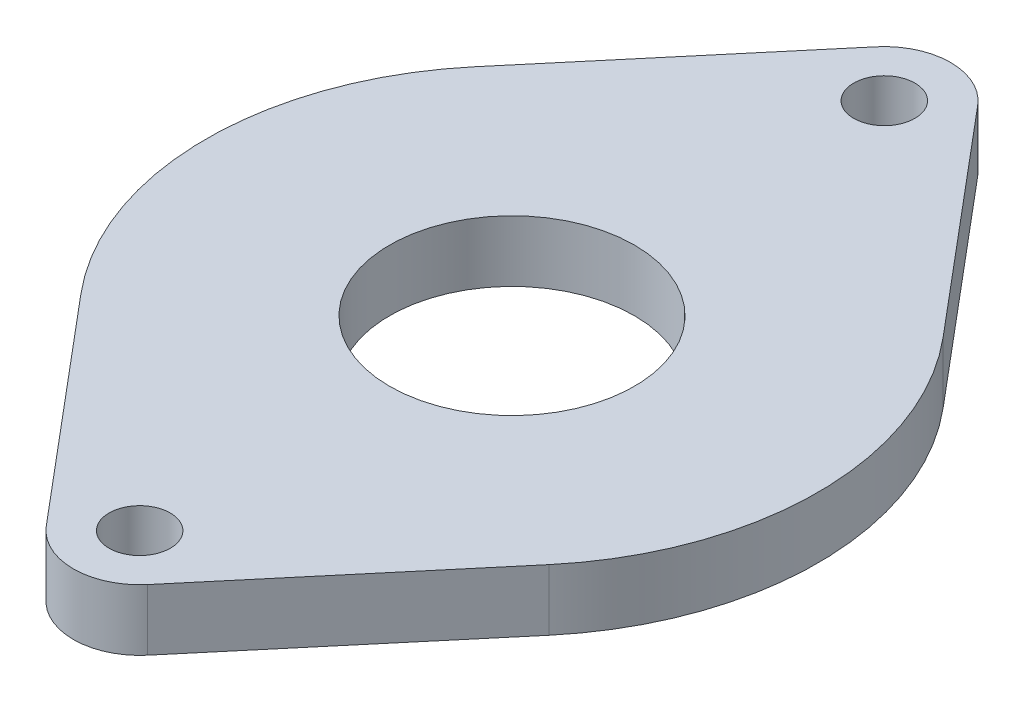
ISO-10303-21;
HEADER;
FILE_DESCRIPTION(('STEP AP214'),'2;1');
FILE_NAME('part.step','',(''),(''),'','','');
FILE_SCHEMA(('AUTOMOTIVE_DESIGN { 1 0 10303 214 1 1 1 1 }'));
ENDSEC;
DATA;
#1=APPLICATION_CONTEXT('core data for automotive mechanical design processes');
#2=APPLICATION_PROTOCOL_DEFINITION('international standard','automotive_design',2000,#1);
#3=PRODUCT_CONTEXT('',#1,'mechanical');
#4=PRODUCT('Part','Part','',(#3));
#5=PRODUCT_RELATED_PRODUCT_CATEGORY('part','',(#4));
#6=PRODUCT_DEFINITION_FORMATION('','',#4);
#7=PRODUCT_DEFINITION_CONTEXT('part definition',#1,'design');
#8=PRODUCT_DEFINITION('design','',#6,#7);
#9=PRODUCT_DEFINITION_SHAPE('','',#8);
#10=(LENGTH_UNIT() NAMED_UNIT(*) SI_UNIT(.MILLI.,.METRE.));
#11=(NAMED_UNIT(*) PLANE_ANGLE_UNIT() SI_UNIT($,.RADIAN.));
#12=(NAMED_UNIT(*) SI_UNIT($,.STERADIAN.) SOLID_ANGLE_UNIT());
#13=UNCERTAINTY_MEASURE_WITH_UNIT(LENGTH_MEASURE(1.E-05),#10,'distance_accuracy_value','');
#14=(GEOMETRIC_REPRESENTATION_CONTEXT(3) GLOBAL_UNCERTAINTY_ASSIGNED_CONTEXT((#13)) GLOBAL_UNIT_ASSIGNED_CONTEXT((#10,
#11,#12)) REPRESENTATION_CONTEXT('',''));
#15=CARTESIAN_POINT('',(0.,0.,0.));
#16=DIRECTION('',(0.,0.,1.));
#17=DIRECTION('',(1.,0.,0.));
#18=AXIS2_PLACEMENT_3D('',#15,#16,#17);
#19=CARTESIAN_POINT('',(0.,3.,18.25));
#20=DIRECTION('',(0.,-1.,0.));
#21=DIRECTION('',(0.,0.,-1.));
#22=AXIS2_PLACEMENT_3D('',#19,#20,#21);
#23=CYLINDRICAL_SURFACE('',#22,3.25);
#24=CARTESIAN_POINT('',(0.,0.,18.25));
#25=DIRECTION('',(0.,1.,0.));
#26=DIRECTION('',(0.,0.,1.));
#27=AXIS2_PLACEMENT_3D('',#24,#25,#26);
#28=CIRCLE('',#27,3.25);
#29=CARTESIAN_POINT('',(2.48678247354789,0.,20.3424657534247));
#30=VERTEX_POINT('',#29);
#31=CARTESIAN_POINT('',(-2.48678247354789,0.,20.3424657534247));
#32=VERTEX_POINT('',#31);
#33=EDGE_CURVE('E140',#30,#32,#28,.F.);
#34=ORIENTED_EDGE('',*,*,#33,.F.);
#35=DIRECTION('',(0.,-1.,0.));
#36=VECTOR('',#35,1.);
#37=CARTESIAN_POINT('',(2.48678247354789,3.,20.3424657534247));
#38=LINE('',#37,#36);
#39=CARTESIAN_POINT('',(2.48678247354789,3.,20.3424657534247));
#40=VERTEX_POINT('',#39);
#41=EDGE_CURVE('E11',#40,#30,#38,.T.);
#42=ORIENTED_EDGE('',*,*,#41,.F.);
#43=CARTESIAN_POINT('',(0.,3.,18.25));
#44=DIRECTION('',(0.,1.,0.));
#45=DIRECTION('',(0.,0.,1.));
#46=AXIS2_PLACEMENT_3D('',#43,#44,#45);
#47=CIRCLE('',#46,3.25);
#48=CARTESIAN_POINT('',(-2.48678247354789,3.,20.3424657534247));
#49=VERTEX_POINT('',#48);
#50=EDGE_CURVE('E167',#40,#49,#47,.F.);
#51=ORIENTED_EDGE('',*,*,#50,.T.);
#52=DIRECTION('',(0.,-1.,0.));
#53=VECTOR('',#52,1.);
#54=CARTESIAN_POINT('',(-2.48678247354789,3.,20.3424657534247));
#55=LINE('',#54,#53);
#56=EDGE_CURVE('E51',#49,#32,#55,.T.);
#57=ORIENTED_EDGE('',*,*,#56,.T.);
#58=EDGE_LOOP('',(#34,#42,#51,#57));
#59=FACE_BOUND('',#58,.T.);
#60=ADVANCED_FACE('F35',(#59),#23,.T.);
#61=CARTESIAN_POINT('',(11.477457570221,3.,9.65753424657534));
#62=DIRECTION('',(-0.765163838014736,0.,-0.643835616438356));
#63=DIRECTION('',(-0.643835616438356,0.,0.765163838014736));
#64=AXIS2_PLACEMENT_3D('',#61,#62,#63);
#65=PLANE('',#64);
#66=DIRECTION('',(0.643835616438356,0.,-0.765163838014736));
#67=VECTOR('',#66,1.);
#68=CARTESIAN_POINT('',(11.477457570221,0.,9.65753424657534));
#69=LINE('',#68,#67);
#70=CARTESIAN_POINT('',(11.477457570221,0.,9.65753424657534));
#71=VERTEX_POINT('',#70);
#72=EDGE_CURVE('E142',#30,#71,#69,.T.);
#73=ORIENTED_EDGE('',*,*,#72,.T.);
#74=DIRECTION('',(0.,-1.,0.));
#75=VECTOR('',#74,1.);
#76=CARTESIAN_POINT('',(11.477457570221,3.,9.65753424657534));
#77=LINE('',#76,#75);
#78=CARTESIAN_POINT('',(11.477457570221,3.,9.65753424657534));
#79=VERTEX_POINT('',#78);
#80=EDGE_CURVE('E43',#79,#71,#77,.T.);
#81=ORIENTED_EDGE('',*,*,#80,.F.);
#82=DIRECTION('',(0.643835616438356,0.,-0.765163838014736));
#83=VECTOR('',#82,1.);
#84=CARTESIAN_POINT('',(11.477457570221,3.,9.65753424657534));
#85=LINE('',#84,#83);
#86=EDGE_CURVE('E194',#40,#79,#85,.T.);
#87=ORIENTED_EDGE('',*,*,#86,.F.);
#88=ORIENTED_EDGE('',*,*,#41,.T.);
#89=EDGE_LOOP('',(#73,#81,#87,#88));
#90=FACE_BOUND('',#89,.T.);
#91=ADVANCED_FACE('F214',(#90),#65,.F.);
#92=CARTESIAN_POINT('',(0.,3.,0.));
#93=DIRECTION('',(0.,-1.,0.));
#94=DIRECTION('',(0.,0.,-1.));
#95=AXIS2_PLACEMENT_3D('',#92,#93,#94);
#96=CYLINDRICAL_SURFACE('',#95,15.);
#97=CARTESIAN_POINT('',(0.,0.,0.));
#98=DIRECTION('',(0.,1.,0.));
#99=DIRECTION('',(0.,0.,1.));
#100=AXIS2_PLACEMENT_3D('',#97,#98,#99);
#101=CIRCLE('',#100,15.);
#102=CARTESIAN_POINT('',(11.477457570221,0.,-9.65753424657534));
#103=VERTEX_POINT('',#102);
#104=EDGE_CURVE('E144',#71,#103,#101,.T.);
#105=ORIENTED_EDGE('',*,*,#104,.T.);
#106=DIRECTION('',(0.,-1.,0.));
#107=VECTOR('',#106,1.);
#108=CARTESIAN_POINT('',(11.477457570221,3.,-9.65753424657534));
#109=LINE('',#108,#107);
#110=CARTESIAN_POINT('',(11.477457570221,3.,-9.65753424657534));
#111=VERTEX_POINT('',#110);
#112=EDGE_CURVE('E173',#111,#103,#109,.T.);
#113=ORIENTED_EDGE('',*,*,#112,.F.);
#114=CARTESIAN_POINT('',(0.,3.,0.));
#115=DIRECTION('',(0.,1.,0.));
#116=DIRECTION('',(0.,0.,1.));
#117=AXIS2_PLACEMENT_3D('',#114,#115,#116);
#118=CIRCLE('',#117,15.);
#119=EDGE_CURVE('E181',#79,#111,#118,.T.);
#120=ORIENTED_EDGE('',*,*,#119,.F.);
#121=ORIENTED_EDGE('',*,*,#80,.T.);
#122=EDGE_LOOP('',(#105,#113,#120,#121));
#123=FACE_BOUND('',#122,.T.);
#124=ADVANCED_FACE('F179',(#123),#96,.T.);
#125=CARTESIAN_POINT('',(11.477457570221,3.,-9.65753424657534));
#126=DIRECTION('',(0.765163838014736,0.,-0.643835616438356));
#127=DIRECTION('',(-0.643835616438356,0.,-0.765163838014736));
#128=AXIS2_PLACEMENT_3D('',#125,#126,#127);
#129=PLANE('',#128);
#130=DIRECTION('',(0.643835616438356,0.,0.765163838014736));
#131=VECTOR('',#130,1.);
#132=CARTESIAN_POINT('',(11.477457570221,0.,-9.65753424657534));
#133=LINE('',#132,#131);
#134=CARTESIAN_POINT('',(2.48678247354789,0.,-20.3424657534247));
#135=VERTEX_POINT('',#134);
#136=EDGE_CURVE('E147',#135,#103,#133,.T.);
#137=ORIENTED_EDGE('',*,*,#136,.F.);
#138=DIRECTION('',(0.,-1.,0.));
#139=VECTOR('',#138,1.);
#140=CARTESIAN_POINT('',(2.48678247354789,3.,-20.3424657534247));
#141=LINE('',#140,#139);
#142=CARTESIAN_POINT('',(2.48678247354789,3.,-20.3424657534247));
#143=VERTEX_POINT('',#142);
#144=EDGE_CURVE('E171',#143,#135,#141,.T.);
#145=ORIENTED_EDGE('',*,*,#144,.F.);
#146=DIRECTION('',(0.643835616438356,0.,0.765163838014736));
#147=VECTOR('',#146,1.);
#148=CARTESIAN_POINT('',(11.477457570221,3.,-9.65753424657534));
#149=LINE('',#148,#147);
#150=EDGE_CURVE('E192',#143,#111,#149,.T.);
#151=ORIENTED_EDGE('',*,*,#150,.T.);
#152=ORIENTED_EDGE('',*,*,#112,.T.);
#153=EDGE_LOOP('',(#137,#145,#151,#152));
#154=FACE_BOUND('',#153,.T.);
#155=ADVANCED_FACE('F190',(#154),#129,.T.);
#156=CARTESIAN_POINT('',(0.,3.,-18.25));
#157=DIRECTION('',(0.,-1.,0.));
#158=DIRECTION('',(0.,0.,-1.));
#159=AXIS2_PLACEMENT_3D('',#156,#157,#158);
#160=CYLINDRICAL_SURFACE('',#159,3.25);
#161=CARTESIAN_POINT('',(0.,0.,-18.25));
#162=DIRECTION('',(0.,1.,0.));
#163=DIRECTION('',(0.,0.,1.));
#164=AXIS2_PLACEMENT_3D('',#161,#162,#163);
#165=CIRCLE('',#164,3.25);
#166=CARTESIAN_POINT('',(-2.48678247354789,0.,-20.3424657534247));
#167=VERTEX_POINT('',#166);
#168=EDGE_CURVE('E150',#135,#167,#165,.T.);
#169=ORIENTED_EDGE('',*,*,#168,.T.);
#170=DIRECTION('',(0.,-1.,0.));
#171=VECTOR('',#170,1.);
#172=CARTESIAN_POINT('',(-2.48678247354789,3.,-20.3424657534247));
#173=LINE('',#172,#171);
#174=CARTESIAN_POINT('',(-2.48678247354789,3.,-20.3424657534247));
#175=VERTEX_POINT('',#174);
#176=EDGE_CURVE('E123',#175,#167,#173,.T.);
#177=ORIENTED_EDGE('',*,*,#176,.F.);
#178=CARTESIAN_POINT('',(0.,3.,-18.25));
#179=DIRECTION('',(0.,1.,0.));
#180=DIRECTION('',(0.,0.,1.));
#181=AXIS2_PLACEMENT_3D('',#178,#179,#180);
#182=CIRCLE('',#181,3.25);
#183=EDGE_CURVE('E111',#143,#175,#182,.T.);
#184=ORIENTED_EDGE('',*,*,#183,.F.);
#185=ORIENTED_EDGE('',*,*,#144,.T.);
#186=EDGE_LOOP('',(#169,#177,#184,#185));
#187=FACE_BOUND('',#186,.T.);
#188=ADVANCED_FACE('F225',(#187),#160,.T.);
#189=CARTESIAN_POINT('',(-11.477457570221,3.,-9.65753424657534));
#190=DIRECTION('',(0.765163838014736,0.,0.643835616438356));
#191=DIRECTION('',(0.643835616438356,0.,-0.765163838014736));
#192=AXIS2_PLACEMENT_3D('',#189,#190,#191);
#193=PLANE('',#192);
#194=DIRECTION('',(-0.643835616438356,0.,0.765163838014736));
#195=VECTOR('',#194,1.);
#196=CARTESIAN_POINT('',(-11.477457570221,0.,-9.65753424657534));
#197=LINE('',#196,#195);
#198=CARTESIAN_POINT('',(-11.477457570221,0.,-9.65753424657534));
#199=VERTEX_POINT('',#198);
#200=EDGE_CURVE('E120',#167,#199,#197,.T.);
#201=ORIENTED_EDGE('',*,*,#200,.T.);
#202=DIRECTION('',(0.,-1.,0.));
#203=VECTOR('',#202,1.);
#204=CARTESIAN_POINT('',(-11.477457570221,3.,-9.65753424657534));
#205=LINE('',#204,#203);
#206=CARTESIAN_POINT('',(-11.477457570221,3.,-9.65753424657534));
#207=VERTEX_POINT('',#206);
#208=EDGE_CURVE('E117',#207,#199,#205,.T.);
#209=ORIENTED_EDGE('',*,*,#208,.F.);
#210=DIRECTION('',(-0.643835616438356,0.,0.765163838014736));
#211=VECTOR('',#210,1.);
#212=CARTESIAN_POINT('',(-11.477457570221,3.,-9.65753424657534));
#213=LINE('',#212,#211);
#214=EDGE_CURVE('E101',#175,#207,#213,.T.);
#215=ORIENTED_EDGE('',*,*,#214,.F.);
#216=ORIENTED_EDGE('',*,*,#176,.T.);
#217=EDGE_LOOP('',(#201,#209,#215,#216));
#218=FACE_BOUND('',#217,.T.);
#219=ADVANCED_FACE('F118',(#218),#193,.F.);
#220=CARTESIAN_POINT('',(0.,3.,0.));
#221=DIRECTION('',(0.,-1.,0.));
#222=DIRECTION('',(0.,0.,-1.));
#223=AXIS2_PLACEMENT_3D('',#220,#221,#222);
#224=CYLINDRICAL_SURFACE('',#223,15.);
#225=CARTESIAN_POINT('',(0.,0.,0.));
#226=DIRECTION('',(0.,1.,0.));
#227=DIRECTION('',(0.,0.,1.));
#228=AXIS2_PLACEMENT_3D('',#225,#226,#227);
#229=CIRCLE('',#228,15.);
#230=CARTESIAN_POINT('',(-11.477457570221,0.,9.65753424657534));
#231=VERTEX_POINT('',#230);
#232=EDGE_CURVE('E153',#199,#231,#229,.T.);
#233=ORIENTED_EDGE('',*,*,#232,.T.);
#234=DIRECTION('',(0.,-1.,0.));
#235=VECTOR('',#234,1.);
#236=CARTESIAN_POINT('',(-11.477457570221,3.,9.65753424657534));
#237=LINE('',#236,#235);
#238=CARTESIAN_POINT('',(-11.477457570221,3.,9.65753424657534));
#239=VERTEX_POINT('',#238);
#240=EDGE_CURVE('E77',#239,#231,#237,.T.);
#241=ORIENTED_EDGE('',*,*,#240,.F.);
#242=CARTESIAN_POINT('',(0.,3.,0.));
#243=DIRECTION('',(0.,1.,0.));
#244=DIRECTION('',(0.,0.,1.));
#245=AXIS2_PLACEMENT_3D('',#242,#243,#244);
#246=CIRCLE('',#245,15.);
#247=EDGE_CURVE('E108',#207,#239,#246,.T.);
#248=ORIENTED_EDGE('',*,*,#247,.F.);
#249=ORIENTED_EDGE('',*,*,#208,.T.);
#250=EDGE_LOOP('',(#233,#241,#248,#249));
#251=FACE_BOUND('',#250,.T.);
#252=ADVANCED_FACE('F125',(#251),#224,.T.);
#253=CARTESIAN_POINT('',(0.,3.,-18.25));
#254=DIRECTION('',(0.,-1.,0.));
#255=DIRECTION('',(0.,0.,-1.));
#256=AXIS2_PLACEMENT_3D('',#253,#254,#255);
#257=CYLINDRICAL_SURFACE('',#256,1.5);
#258=CARTESIAN_POINT('',(0.,3.,-18.25));
#259=DIRECTION('',(0.,1.,0.));
#260=DIRECTION('',(0.,0.,1.));
#261=AXIS2_PLACEMENT_3D('',#258,#259,#260);
#262=CIRCLE('',#261,1.5);
#263=CARTESIAN_POINT('',(0.,3.,-16.75));
#264=VERTEX_POINT('',#263);
#265=EDGE_CURVE('E134',#264,#264,#262,.T.);
#266=ORIENTED_EDGE('',*,*,#265,.T.);
#267=EDGE_LOOP('',(#266));
#268=FACE_BOUND('',#267,.T.);
#269=CARTESIAN_POINT('',(0.,0.,-18.25));
#270=DIRECTION('',(0.,1.,0.));
#271=DIRECTION('',(0.,0.,1.));
#272=AXIS2_PLACEMENT_3D('',#269,#270,#271);
#273=CIRCLE('',#272,1.5);
#274=CARTESIAN_POINT('',(0.,0.,-16.75));
#275=VERTEX_POINT('',#274);
#276=EDGE_CURVE('E161',#275,#275,#273,.T.);
#277=ORIENTED_EDGE('',*,*,#276,.F.);
#278=EDGE_LOOP('',(#277));
#279=FACE_BOUND('',#278,.T.);
#280=ADVANCED_FACE('F209',(#268,#279),#257,.F.);
#281=CARTESIAN_POINT('',(0.,3.,0.));
#282=DIRECTION('',(0.,-1.,0.));
#283=DIRECTION('',(0.,0.,-1.));
#284=AXIS2_PLACEMENT_3D('',#281,#282,#283);
#285=CYLINDRICAL_SURFACE('',#284,6.);
#286=CARTESIAN_POINT('',(0.,3.,0.));
#287=DIRECTION('',(0.,1.,0.));
#288=DIRECTION('',(0.,0.,1.));
#289=AXIS2_PLACEMENT_3D('',#286,#287,#288);
#290=CIRCLE('',#289,6.);
#291=CARTESIAN_POINT('',(0.,3.,6.));
#292=VERTEX_POINT('',#291);
#293=EDGE_CURVE('E128',#292,#292,#290,.T.);
#294=ORIENTED_EDGE('',*,*,#293,.T.);
#295=EDGE_LOOP('',(#294));
#296=FACE_BOUND('',#295,.T.);
#297=CARTESIAN_POINT('',(0.,0.,0.));
#298=DIRECTION('',(0.,1.,0.));
#299=DIRECTION('',(0.,0.,1.));
#300=AXIS2_PLACEMENT_3D('',#297,#298,#299);
#301=CIRCLE('',#300,6.);
#302=CARTESIAN_POINT('',(0.,0.,6.));
#303=VERTEX_POINT('',#302);
#304=EDGE_CURVE('E158',#303,#303,#301,.T.);
#305=ORIENTED_EDGE('',*,*,#304,.F.);
#306=EDGE_LOOP('',(#305));
#307=FACE_BOUND('',#306,.T.);
#308=ADVANCED_FACE('F201',(#296,#307),#285,.F.);
#309=CARTESIAN_POINT('',(-11.477457570221,3.,9.65753424657534));
#310=DIRECTION('',(-0.765163838014736,0.,0.643835616438356));
#311=DIRECTION('',(0.643835616438356,0.,0.765163838014736));
#312=AXIS2_PLACEMENT_3D('',#309,#310,#311);
#313=PLANE('',#312);
#314=DIRECTION('',(-0.643835616438356,0.,-0.765163838014736));
#315=VECTOR('',#314,1.);
#316=CARTESIAN_POINT('',(-11.477457570221,0.,9.65753424657534));
#317=LINE('',#316,#315);
#318=EDGE_CURVE('E155',#32,#231,#317,.T.);
#319=ORIENTED_EDGE('',*,*,#318,.F.);
#320=ORIENTED_EDGE('',*,*,#56,.F.);
#321=DIRECTION('',(-0.643835616438356,0.,-0.765163838014736));
#322=VECTOR('',#321,1.);
#323=CARTESIAN_POINT('',(-11.477457570221,3.,9.65753424657534));
#324=LINE('',#323,#322);
#325=EDGE_CURVE('E126',#49,#239,#324,.T.);
#326=ORIENTED_EDGE('',*,*,#325,.T.);
#327=ORIENTED_EDGE('',*,*,#240,.T.);
#328=EDGE_LOOP('',(#319,#320,#326,#327));
#329=FACE_BOUND('',#328,.T.);
#330=ADVANCED_FACE('F198',(#329),#313,.T.);
#331=CARTESIAN_POINT('',(0.,3.,18.25));
#332=DIRECTION('',(0.,-1.,0.));
#333=DIRECTION('',(0.,0.,-1.));
#334=AXIS2_PLACEMENT_3D('',#331,#332,#333);
#335=CYLINDRICAL_SURFACE('',#334,1.5);
#336=CARTESIAN_POINT('',(0.,3.,18.25));
#337=DIRECTION('',(0.,1.,0.));
#338=DIRECTION('',(0.,0.,1.));
#339=AXIS2_PLACEMENT_3D('',#336,#337,#338);
#340=CIRCLE('',#339,1.5);
#341=CARTESIAN_POINT('',(0.,3.,19.75));
#342=VERTEX_POINT('',#341);
#343=EDGE_CURVE('E137',#342,#342,#340,.F.);
#344=ORIENTED_EDGE('',*,*,#343,.F.);
#345=EDGE_LOOP('',(#344));
#346=FACE_BOUND('',#345,.T.);
#347=CARTESIAN_POINT('',(0.,0.,18.25));
#348=DIRECTION('',(0.,1.,0.));
#349=DIRECTION('',(0.,0.,1.));
#350=AXIS2_PLACEMENT_3D('',#347,#348,#349);
#351=CIRCLE('',#350,1.5);
#352=CARTESIAN_POINT('',(0.,0.,19.75));
#353=VERTEX_POINT('',#352);
#354=EDGE_CURVE('E164',#353,#353,#351,.F.);
#355=ORIENTED_EDGE('',*,*,#354,.T.);
#356=EDGE_LOOP('',(#355));
#357=FACE_BOUND('',#356,.T.);
#358=ADVANCED_FACE('F200',(#346,#357),#335,.F.);
#359=CARTESIAN_POINT('',(0.,3.,0.));
#360=DIRECTION('',(0.,1.,0.));
#361=DIRECTION('',(0.,0.,1.));
#362=AXIS2_PLACEMENT_3D('',#359,#360,#361);
#363=PLANE('',#362);
#364=ORIENTED_EDGE('',*,*,#50,.F.);
#365=ORIENTED_EDGE('',*,*,#86,.T.);
#366=ORIENTED_EDGE('',*,*,#119,.T.);
#367=ORIENTED_EDGE('',*,*,#150,.F.);
#368=ORIENTED_EDGE('',*,*,#183,.T.);
#369=ORIENTED_EDGE('',*,*,#214,.T.);
#370=ORIENTED_EDGE('',*,*,#247,.T.);
#371=ORIENTED_EDGE('',*,*,#325,.F.);
#372=EDGE_LOOP('',(#364,#365,#366,#367,#368,#369,#370,#371));
#373=FACE_BOUND('',#372,.T.);
#374=ORIENTED_EDGE('',*,*,#293,.F.);
#375=EDGE_LOOP('',(#374));
#376=FACE_BOUND('',#375,.T.);
#377=ORIENTED_EDGE('',*,*,#265,.F.);
#378=EDGE_LOOP('',(#377));
#379=FACE_BOUND('',#378,.T.);
#380=ORIENTED_EDGE('',*,*,#343,.T.);
#381=EDGE_LOOP('',(#380));
#382=FACE_BOUND('',#381,.T.);
#383=ADVANCED_FACE('F104',(#373,#376,#379,#382),#363,.T.);
#384=CARTESIAN_POINT('',(0.,0.,0.));
#385=DIRECTION('',(0.,1.,0.));
#386=DIRECTION('',(0.,0.,1.));
#387=AXIS2_PLACEMENT_3D('',#384,#385,#386);
#388=PLANE('',#387);
#389=ORIENTED_EDGE('',*,*,#33,.T.);
#390=ORIENTED_EDGE('',*,*,#318,.T.);
#391=ORIENTED_EDGE('',*,*,#232,.F.);
#392=ORIENTED_EDGE('',*,*,#200,.F.);
#393=ORIENTED_EDGE('',*,*,#168,.F.);
#394=ORIENTED_EDGE('',*,*,#136,.T.);
#395=ORIENTED_EDGE('',*,*,#104,.F.);
#396=ORIENTED_EDGE('',*,*,#72,.F.);
#397=EDGE_LOOP('',(#389,#390,#391,#392,#393,#394,#395,#396));
#398=FACE_BOUND('',#397,.T.);
#399=ORIENTED_EDGE('',*,*,#304,.T.);
#400=EDGE_LOOP('',(#399));
#401=FACE_BOUND('',#400,.T.);
#402=ORIENTED_EDGE('',*,*,#276,.T.);
#403=EDGE_LOOP('',(#402));
#404=FACE_BOUND('',#403,.T.);
#405=ORIENTED_EDGE('',*,*,#354,.F.);
#406=EDGE_LOOP('',(#405));
#407=FACE_BOUND('',#406,.T.);
#408=ADVANCED_FACE('F185',(#398,#401,#404,#407),#388,.F.);
#409=CLOSED_SHELL('',(#60,#91,#124,#155,#188,#219,#252,#280,#308,#330,#358,#383,#408));
#410=MANIFOLD_SOLID_BREP('B2',#409);
#411=ADVANCED_BREP_SHAPE_REPRESENTATION('',(#18,#410),#14);
#412=SHAPE_DEFINITION_REPRESENTATION(#9,#411);
ENDSEC;
END-ISO-10303-21;
